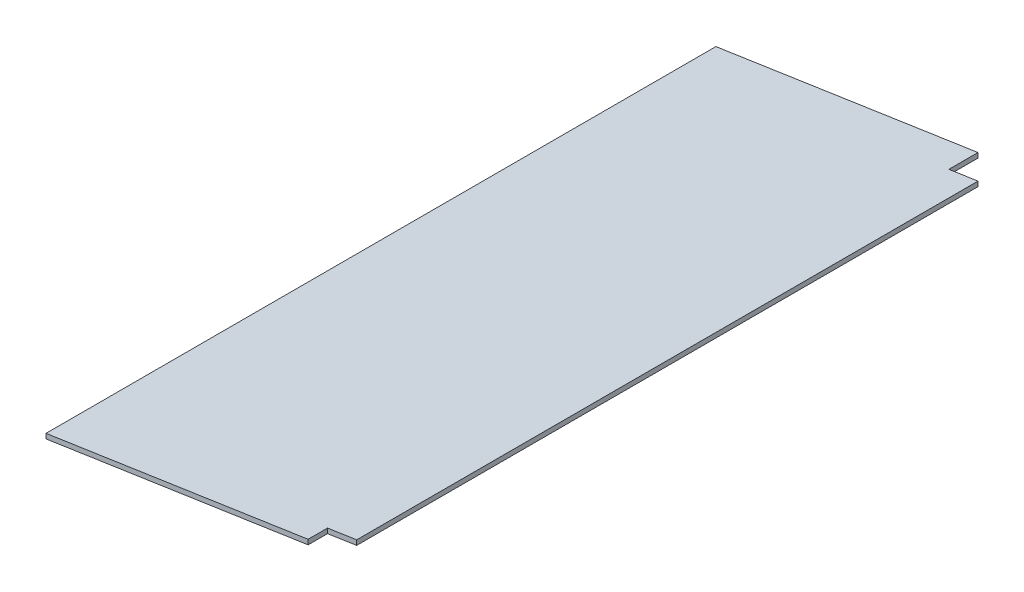
ISO-10303-21;
HEADER;
FILE_DESCRIPTION(('STEP AP214'),'2;1');
FILE_NAME('part.step','',(''),(''),'','','');
FILE_SCHEMA(('AUTOMOTIVE_DESIGN { 1 0 10303 214 1 1 1 1 }'));
ENDSEC;
DATA;
#1=APPLICATION_CONTEXT('core data for automotive mechanical design processes');
#2=APPLICATION_PROTOCOL_DEFINITION('international standard','automotive_design',2000,#1);
#3=PRODUCT_CONTEXT('',#1,'mechanical');
#4=PRODUCT('Part','Part','',(#3));
#5=PRODUCT_RELATED_PRODUCT_CATEGORY('part','',(#4));
#6=PRODUCT_DEFINITION_FORMATION('','',#4);
#7=PRODUCT_DEFINITION_CONTEXT('part definition',#1,'design');
#8=PRODUCT_DEFINITION('design','',#6,#7);
#9=PRODUCT_DEFINITION_SHAPE('','',#8);
#10=(LENGTH_UNIT() NAMED_UNIT(*) SI_UNIT(.MILLI.,.METRE.));
#11=(NAMED_UNIT(*) PLANE_ANGLE_UNIT() SI_UNIT($,.RADIAN.));
#12=(NAMED_UNIT(*) SI_UNIT($,.STERADIAN.) SOLID_ANGLE_UNIT());
#13=UNCERTAINTY_MEASURE_WITH_UNIT(LENGTH_MEASURE(1.E-05),#10,'distance_accuracy_value','');
#14=(GEOMETRIC_REPRESENTATION_CONTEXT(3) GLOBAL_UNCERTAINTY_ASSIGNED_CONTEXT((#13)) GLOBAL_UNIT_ASSIGNED_CONTEXT((#10,
#11,#12)) REPRESENTATION_CONTEXT('',''));
#15=CARTESIAN_POINT('',(0.,0.,0.));
#16=DIRECTION('',(0.,0.,1.));
#17=DIRECTION('',(1.,0.,0.));
#18=AXIS2_PLACEMENT_3D('',#15,#16,#17);
#19=CARTESIAN_POINT('',(0.,0.,690.));
#20=DIRECTION('',(-0.148340452930245,0.988936352868298,0.));
#21=DIRECTION('',(-0.988936352868298,-0.148340452930245,0.));
#22=AXIS2_PLACEMENT_3D('',#19,#20,#21);
#23=PLANE('',#22);
#24=DIRECTION('',(0.988936352868298,0.148340452930245,0.));
#25=VECTOR('',#24,1.);
#26=CARTESIAN_POINT('',(0.,0.,670.));
#27=LINE('',#26,#25);
#28=CARTESIAN_POINT('',(270.,40.5,670.));
#29=VERTEX_POINT('',#28);
#30=CARTESIAN_POINT('',(300.,45.,670.));
#31=VERTEX_POINT('',#30);
#32=EDGE_CURVE('E118',#29,#31,#27,.T.);
#33=ORIENTED_EDGE('',*,*,#32,.F.);
#34=DIRECTION('',(0.,0.,1.));
#35=VECTOR('',#34,1.);
#36=CARTESIAN_POINT('',(270.,40.5,690.));
#37=LINE('',#36,#35);
#38=CARTESIAN_POINT('',(270.,40.5,690.));
#39=VERTEX_POINT('',#38);
#40=EDGE_CURVE('E178',#29,#39,#37,.T.);
#41=ORIENTED_EDGE('',*,*,#40,.T.);
#42=DIRECTION('',(0.988936352868298,0.148340452930245,0.));
#43=VECTOR('',#42,1.);
#44=CARTESIAN_POINT('',(0.,0.,690.));
#45=LINE('',#44,#43);
#46=CARTESIAN_POINT('',(0.,0.,690.));
#47=VERTEX_POINT('',#46);
#48=EDGE_CURVE('E191',#47,#39,#45,.T.);
#49=ORIENTED_EDGE('',*,*,#48,.F.);
#50=DIRECTION('',(0.,0.,-1.));
#51=VECTOR('',#50,1.);
#52=CARTESIAN_POINT('',(0.,0.,690.));
#53=LINE('',#52,#51);
#54=CARTESIAN_POINT('',(0.,0.,0.));
#55=VERTEX_POINT('',#54);
#56=EDGE_CURVE('E142',#47,#55,#53,.T.);
#57=ORIENTED_EDGE('',*,*,#56,.T.);
#58=DIRECTION('',(0.988936352868298,0.148340452930245,0.));
#59=VECTOR('',#58,1.);
#60=CARTESIAN_POINT('',(0.,0.,0.));
#61=LINE('',#60,#59);
#62=CARTESIAN_POINT('',(270.,40.5,0.));
#63=VERTEX_POINT('',#62);
#64=EDGE_CURVE('E201',#55,#63,#61,.T.);
#65=ORIENTED_EDGE('',*,*,#64,.T.);
#66=DIRECTION('',(0.,0.,-1.));
#67=VECTOR('',#66,1.);
#68=CARTESIAN_POINT('',(270.,40.5,690.));
#69=LINE('',#68,#67);
#70=CARTESIAN_POINT('',(270.,40.5,30.));
#71=VERTEX_POINT('',#70);
#72=EDGE_CURVE('E71',#71,#63,#69,.T.);
#73=ORIENTED_EDGE('',*,*,#72,.F.);
#74=DIRECTION('',(0.988936352868298,0.148340452930245,0.));
#75=VECTOR('',#74,1.);
#76=CARTESIAN_POINT('',(-1.49296494753994E-13,0.,30.));
#77=LINE('',#76,#75);
#78=CARTESIAN_POINT('',(300.,45.,30.));
#79=VERTEX_POINT('',#78);
#80=EDGE_CURVE('E164',#71,#79,#77,.T.);
#81=ORIENTED_EDGE('',*,*,#80,.T.);
#82=DIRECTION('',(0.,0.,-1.));
#83=VECTOR('',#82,1.);
#84=CARTESIAN_POINT('',(300.,45.,690.));
#85=LINE('',#84,#83);
#86=EDGE_CURVE('E137',#31,#79,#85,.T.);
#87=ORIENTED_EDGE('',*,*,#86,.F.);
#88=EDGE_LOOP('',(#33,#41,#49,#57,#65,#73,#81,#87));
#89=FACE_BOUND('',#88,.T.);
#90=ADVANCED_FACE('F47',(#89),#23,.F.);
#91=CARTESIAN_POINT('',(300.,0.,690.));
#92=DIRECTION('',(-1.,0.,0.));
#93=DIRECTION('',(0.,0.,1.));
#94=AXIS2_PLACEMENT_3D('',#91,#92,#93);
#95=PLANE('',#94);
#96=DIRECTION('',(0.,-1.,0.));
#97=VECTOR('',#96,1.);
#98=CARTESIAN_POINT('',(300.,50.,670.));
#99=LINE('',#98,#97);
#100=CARTESIAN_POINT('',(300.,50.,670.));
#101=VERTEX_POINT('',#100);
#102=EDGE_CURVE('E113',#101,#31,#99,.T.);
#103=ORIENTED_EDGE('',*,*,#102,.T.);
#104=ORIENTED_EDGE('',*,*,#86,.T.);
#105=DIRECTION('',(0.,-1.,0.));
#106=VECTOR('',#105,1.);
#107=CARTESIAN_POINT('',(300.,50.,30.));
#108=LINE('',#107,#106);
#109=CARTESIAN_POINT('',(300.,50.,30.));
#110=VERTEX_POINT('',#109);
#111=EDGE_CURVE('E135',#110,#79,#108,.T.);
#112=ORIENTED_EDGE('',*,*,#111,.F.);
#113=DIRECTION('',(0.,0.,-1.));
#114=VECTOR('',#113,1.);
#115=CARTESIAN_POINT('',(300.,50.,690.));
#116=LINE('',#115,#114);
#117=EDGE_CURVE('E132',#101,#110,#116,.T.);
#118=ORIENTED_EDGE('',*,*,#117,.F.);
#119=EDGE_LOOP('',(#103,#104,#112,#118));
#120=FACE_BOUND('',#119,.T.);
#121=ADVANCED_FACE('F134',(#120),#95,.F.);
#122=CARTESIAN_POINT('',(-0.733496332518339,4.88997555012226,690.));
#123=DIRECTION('',(0.148340452930245,-0.988936352868298,0.));
#124=DIRECTION('',(0.988936352868298,0.148340452930245,0.));
#125=AXIS2_PLACEMENT_3D('',#122,#123,#124);
#126=PLANE('',#125);
#127=DIRECTION('',(-0.988936352868298,-0.148340452930245,0.));
#128=VECTOR('',#127,1.);
#129=CARTESIAN_POINT('',(-0.733496332518339,4.88997555012226,690.));
#130=LINE('',#129,#128);
#131=CARTESIAN_POINT('',(270.,45.5,690.));
#132=VERTEX_POINT('',#131);
#133=CARTESIAN_POINT('',(0.,5.,690.));
#134=VERTEX_POINT('',#133);
#135=EDGE_CURVE('E145',#132,#134,#130,.T.);
#136=ORIENTED_EDGE('',*,*,#135,.F.);
#137=DIRECTION('',(0.,0.,-1.));
#138=VECTOR('',#137,1.);
#139=CARTESIAN_POINT('',(270.,45.5,690.));
#140=LINE('',#139,#138);
#141=CARTESIAN_POINT('',(270.,45.5,670.));
#142=VERTEX_POINT('',#141);
#143=EDGE_CURVE('E63',#132,#142,#140,.T.);
#144=ORIENTED_EDGE('',*,*,#143,.T.);
#145=DIRECTION('',(-0.988936352868298,-0.148340452930245,0.));
#146=VECTOR('',#145,1.);
#147=CARTESIAN_POINT('',(-0.733496332518339,4.88997555012226,670.));
#148=LINE('',#147,#146);
#149=EDGE_CURVE('E11',#101,#142,#148,.T.);
#150=ORIENTED_EDGE('',*,*,#149,.F.);
#151=ORIENTED_EDGE('',*,*,#117,.T.);
#152=DIRECTION('',(-0.988936352868298,-0.148340452930245,0.));
#153=VECTOR('',#152,1.);
#154=CARTESIAN_POINT('',(-0.733496332518488,4.88997555012224,30.));
#155=LINE('',#154,#153);
#156=CARTESIAN_POINT('',(270.,45.5,30.));
#157=VERTEX_POINT('',#156);
#158=EDGE_CURVE('E56',#110,#157,#155,.T.);
#159=ORIENTED_EDGE('',*,*,#158,.T.);
#160=DIRECTION('',(0.,0.,1.));
#161=VECTOR('',#160,1.);
#162=CARTESIAN_POINT('',(270.,45.5,690.));
#163=LINE('',#162,#161);
#164=CARTESIAN_POINT('',(270.,45.5,0.));
#165=VERTEX_POINT('',#164);
#166=EDGE_CURVE('E124',#165,#157,#163,.T.);
#167=ORIENTED_EDGE('',*,*,#166,.F.);
#168=DIRECTION('',(-0.988936352868298,-0.148340452930245,0.));
#169=VECTOR('',#168,1.);
#170=CARTESIAN_POINT('',(-0.733496332518339,4.88997555012226,0.));
#171=LINE('',#170,#169);
#172=CARTESIAN_POINT('',(0.,5.,0.));
#173=VERTEX_POINT('',#172);
#174=EDGE_CURVE('E192',#165,#173,#171,.T.);
#175=ORIENTED_EDGE('',*,*,#174,.T.);
#176=DIRECTION('',(0.,0.,-1.));
#177=VECTOR('',#176,1.);
#178=CARTESIAN_POINT('',(0.,5.,690.));
#179=LINE('',#178,#177);
#180=EDGE_CURVE('E138',#134,#173,#179,.T.);
#181=ORIENTED_EDGE('',*,*,#180,.F.);
#182=EDGE_LOOP('',(#136,#144,#150,#151,#159,#167,#175,#181));
#183=FACE_BOUND('',#182,.T.);
#184=ADVANCED_FACE('F130',(#183),#126,.F.);
#185=CARTESIAN_POINT('',(0.,0.,0.));
#186=DIRECTION('',(0.,0.,1.));
#187=DIRECTION('',(1.,0.,0.));
#188=AXIS2_PLACEMENT_3D('',#185,#186,#187);
#189=PLANE('',#188);
#190=DIRECTION('',(0.,1.,0.));
#191=VECTOR('',#190,1.);
#192=CARTESIAN_POINT('',(270.,0.,0.));
#193=LINE('',#192,#191);
#194=EDGE_CURVE('E151',#63,#165,#193,.T.);
#195=ORIENTED_EDGE('',*,*,#194,.F.);
#196=ORIENTED_EDGE('',*,*,#64,.F.);
#197=DIRECTION('',(0.,1.,0.));
#198=VECTOR('',#197,1.);
#199=CARTESIAN_POINT('',(0.,0.,0.));
#200=LINE('',#199,#198);
#201=EDGE_CURVE('E186',#55,#173,#200,.T.);
#202=ORIENTED_EDGE('',*,*,#201,.T.);
#203=ORIENTED_EDGE('',*,*,#174,.F.);
#204=EDGE_LOOP('',(#195,#196,#202,#203));
#205=FACE_BOUND('',#204,.T.);
#206=ADVANCED_FACE('F211',(#205),#189,.F.);
#207=CARTESIAN_POINT('',(0.,0.,690.));
#208=DIRECTION('',(-1.,0.,0.));
#209=DIRECTION('',(0.,0.,1.));
#210=AXIS2_PLACEMENT_3D('',#207,#208,#209);
#211=PLANE('',#210);
#212=ORIENTED_EDGE('',*,*,#201,.F.);
#213=ORIENTED_EDGE('',*,*,#56,.F.);
#214=DIRECTION('',(0.,1.,0.));
#215=VECTOR('',#214,1.);
#216=CARTESIAN_POINT('',(0.,0.,690.));
#217=LINE('',#216,#215);
#218=EDGE_CURVE('E187',#47,#134,#217,.T.);
#219=ORIENTED_EDGE('',*,*,#218,.T.);
#220=ORIENTED_EDGE('',*,*,#180,.T.);
#221=EDGE_LOOP('',(#212,#213,#219,#220));
#222=FACE_BOUND('',#221,.T.);
#223=ADVANCED_FACE('F49',(#222),#211,.T.);
#224=CARTESIAN_POINT('',(0.,0.,690.));
#225=DIRECTION('',(0.,0.,1.));
#226=DIRECTION('',(1.,0.,0.));
#227=AXIS2_PLACEMENT_3D('',#224,#225,#226);
#228=PLANE('',#227);
#229=DIRECTION('',(0.,-1.,0.));
#230=VECTOR('',#229,1.);
#231=CARTESIAN_POINT('',(270.,0.,690.));
#232=LINE('',#231,#230);
#233=EDGE_CURVE('E154',#132,#39,#232,.T.);
#234=ORIENTED_EDGE('',*,*,#233,.F.);
#235=ORIENTED_EDGE('',*,*,#135,.T.);
#236=ORIENTED_EDGE('',*,*,#218,.F.);
#237=ORIENTED_EDGE('',*,*,#48,.T.);
#238=EDGE_LOOP('',(#234,#235,#236,#237));
#239=FACE_BOUND('',#238,.T.);
#240=ADVANCED_FACE('F215',(#239),#228,.T.);
#241=CARTESIAN_POINT('',(0.,50.,30.0000000000001));
#242=DIRECTION('',(0.,0.,1.));
#243=DIRECTION('',(1.,0.,0.));
#244=AXIS2_PLACEMENT_3D('',#241,#242,#243);
#245=PLANE('',#244);
#246=DIRECTION('',(0.,-1.,0.));
#247=VECTOR('',#246,1.);
#248=CARTESIAN_POINT('',(270.,50.,30.));
#249=LINE('',#248,#247);
#250=EDGE_CURVE('E163',#157,#71,#249,.T.);
#251=ORIENTED_EDGE('',*,*,#250,.F.);
#252=ORIENTED_EDGE('',*,*,#158,.F.);
#253=ORIENTED_EDGE('',*,*,#111,.T.);
#254=ORIENTED_EDGE('',*,*,#80,.F.);
#255=EDGE_LOOP('',(#251,#252,#253,#254));
#256=FACE_BOUND('',#255,.T.);
#257=ADVANCED_FACE('F161',(#256),#245,.F.);
#258=CARTESIAN_POINT('',(270.,50.,0.));
#259=DIRECTION('',(1.,0.,0.));
#260=DIRECTION('',(0.,0.,-1.));
#261=AXIS2_PLACEMENT_3D('',#258,#259,#260);
#262=PLANE('',#261);
#263=ORIENTED_EDGE('',*,*,#72,.T.);
#264=ORIENTED_EDGE('',*,*,#194,.T.);
#265=ORIENTED_EDGE('',*,*,#166,.T.);
#266=ORIENTED_EDGE('',*,*,#250,.T.);
#267=EDGE_LOOP('',(#263,#264,#265,#266));
#268=FACE_BOUND('',#267,.T.);
#269=ADVANCED_FACE('F222',(#268),#262,.T.);
#270=CARTESIAN_POINT('',(0.,50.,670.));
#271=DIRECTION('',(0.,0.,1.));
#272=DIRECTION('',(1.,0.,0.));
#273=AXIS2_PLACEMENT_3D('',#270,#271,#272);
#274=PLANE('',#273);
#275=ORIENTED_EDGE('',*,*,#32,.T.);
#276=ORIENTED_EDGE('',*,*,#102,.F.);
#277=ORIENTED_EDGE('',*,*,#149,.T.);
#278=DIRECTION('',(0.,-1.,0.));
#279=VECTOR('',#278,1.);
#280=CARTESIAN_POINT('',(270.,50.,670.));
#281=LINE('',#280,#279);
#282=EDGE_CURVE('E125',#142,#29,#281,.T.);
#283=ORIENTED_EDGE('',*,*,#282,.T.);
#284=EDGE_LOOP('',(#275,#276,#277,#283));
#285=FACE_BOUND('',#284,.T.);
#286=ADVANCED_FACE('F115',(#285),#274,.T.);
#287=CARTESIAN_POINT('',(270.,50.,0.));
#288=DIRECTION('',(-1.,0.,0.));
#289=DIRECTION('',(0.,0.,1.));
#290=AXIS2_PLACEMENT_3D('',#287,#288,#289);
#291=PLANE('',#290);
#292=ORIENTED_EDGE('',*,*,#282,.F.);
#293=ORIENTED_EDGE('',*,*,#143,.F.);
#294=ORIENTED_EDGE('',*,*,#233,.T.);
#295=ORIENTED_EDGE('',*,*,#40,.F.);
#296=EDGE_LOOP('',(#292,#293,#294,#295));
#297=FACE_BOUND('',#296,.T.);
#298=ADVANCED_FACE('F216',(#297),#291,.F.);
#299=CLOSED_SHELL('',(#90,#121,#184,#206,#223,#240,#257,#269,#286,#298));
#300=MANIFOLD_SOLID_BREP('B2',#299);
#301=ADVANCED_BREP_SHAPE_REPRESENTATION('',(#18,#300),#14);
#302=SHAPE_DEFINITION_REPRESENTATION(#9,#301);
ENDSEC;
END-ISO-10303-21;
